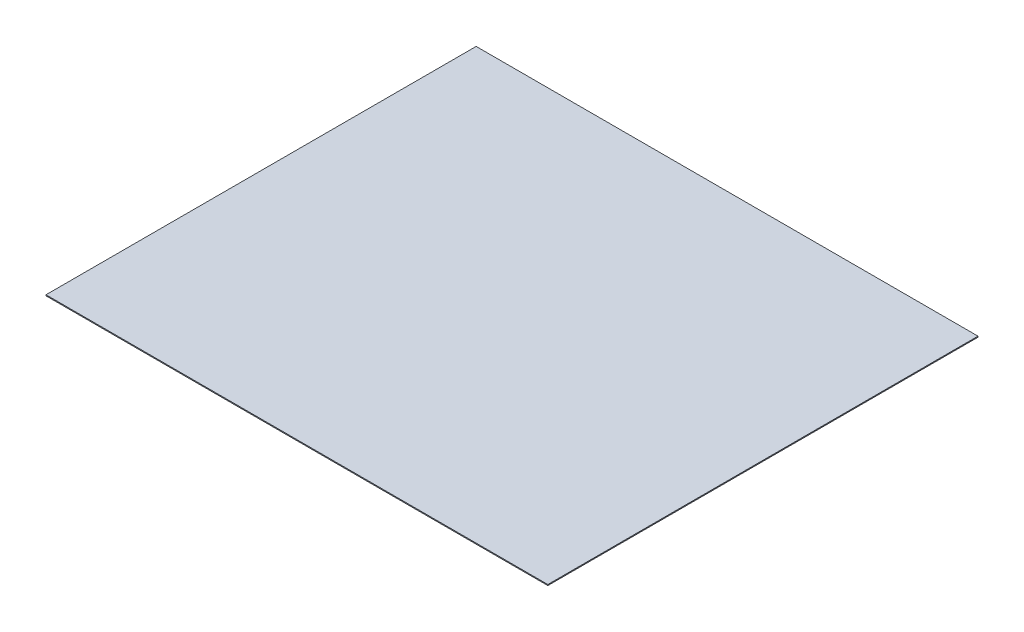
ISO-10303-21;
HEADER;
FILE_DESCRIPTION(('STEP AP214'),'2;1');
FILE_NAME('part.step','',(''),(''),'','','');
FILE_SCHEMA(('AUTOMOTIVE_DESIGN { 1 0 10303 214 1 1 1 1 }'));
ENDSEC;
DATA;
#1=APPLICATION_CONTEXT('core data for automotive mechanical design processes');
#2=APPLICATION_PROTOCOL_DEFINITION('international standard','automotive_design',2000,#1);
#3=PRODUCT_CONTEXT('',#1,'mechanical');
#4=PRODUCT('Part','Part','',(#3));
#5=PRODUCT_RELATED_PRODUCT_CATEGORY('part','',(#4));
#6=PRODUCT_DEFINITION_FORMATION('','',#4);
#7=PRODUCT_DEFINITION_CONTEXT('part definition',#1,'design');
#8=PRODUCT_DEFINITION('design','',#6,#7);
#9=PRODUCT_DEFINITION_SHAPE('','',#8);
#10=(LENGTH_UNIT() NAMED_UNIT(*) SI_UNIT(.MILLI.,.METRE.));
#11=(NAMED_UNIT(*) PLANE_ANGLE_UNIT() SI_UNIT($,.RADIAN.));
#12=(NAMED_UNIT(*) SI_UNIT($,.STERADIAN.) SOLID_ANGLE_UNIT());
#13=UNCERTAINTY_MEASURE_WITH_UNIT(LENGTH_MEASURE(1.E-05),#10,'distance_accuracy_value','');
#14=(GEOMETRIC_REPRESENTATION_CONTEXT(3) GLOBAL_UNCERTAINTY_ASSIGNED_CONTEXT((#13)) GLOBAL_UNIT_ASSIGNED_CONTEXT((#10,
#11,#12)) REPRESENTATION_CONTEXT('',''));
#15=CARTESIAN_POINT('',(0.,0.,0.));
#16=DIRECTION('',(0.,0.,1.));
#17=DIRECTION('',(1.,0.,0.));
#18=AXIS2_PLACEMENT_3D('',#15,#16,#17);
#19=CARTESIAN_POINT('',(133.35,0.508,-114.3));
#20=DIRECTION('',(-1.,0.,0.));
#21=DIRECTION('',(0.,0.,1.));
#22=AXIS2_PLACEMENT_3D('',#19,#20,#21);
#23=PLANE('',#22);
#24=DIRECTION('',(0.,0.,-1.));
#25=VECTOR('',#24,1.);
#26=CARTESIAN_POINT('',(133.35,0.,-114.3));
#27=LINE('',#26,#25);
#28=CARTESIAN_POINT('',(133.35,0.,114.3));
#29=VERTEX_POINT('',#28);
#30=CARTESIAN_POINT('',(133.35,0.,-114.3));
#31=VERTEX_POINT('',#30);
#32=EDGE_CURVE('E107',#29,#31,#27,.T.);
#33=ORIENTED_EDGE('',*,*,#32,.T.);
#34=DIRECTION('',(0.,-1.,0.));
#35=VECTOR('',#34,1.);
#36=CARTESIAN_POINT('',(133.35,0.508,-114.3));
#37=LINE('',#36,#35);
#38=CARTESIAN_POINT('',(133.35,0.508,-114.3));
#39=VERTEX_POINT('',#38);
#40=EDGE_CURVE('E11',#39,#31,#37,.T.);
#41=ORIENTED_EDGE('',*,*,#40,.F.);
#42=DIRECTION('',(0.,0.,-1.));
#43=VECTOR('',#42,1.);
#44=CARTESIAN_POINT('',(133.35,0.508,-114.3));
#45=LINE('',#44,#43);
#46=CARTESIAN_POINT('',(133.35,0.508,114.3));
#47=VERTEX_POINT('',#46);
#48=EDGE_CURVE('E91',#47,#39,#45,.T.);
#49=ORIENTED_EDGE('',*,*,#48,.F.);
#50=DIRECTION('',(0.,-1.,0.));
#51=VECTOR('',#50,1.);
#52=CARTESIAN_POINT('',(133.35,0.508,114.3));
#53=LINE('',#52,#51);
#54=EDGE_CURVE('E103',#47,#29,#53,.T.);
#55=ORIENTED_EDGE('',*,*,#54,.T.);
#56=EDGE_LOOP('',(#33,#41,#49,#55));
#57=FACE_BOUND('',#56,.T.);
#58=ADVANCED_FACE('F39',(#57),#23,.F.);
#59=CARTESIAN_POINT('',(-133.35,0.508,-114.3));
#60=DIRECTION('',(0.,0.,1.));
#61=DIRECTION('',(1.,0.,0.));
#62=AXIS2_PLACEMENT_3D('',#59,#60,#61);
#63=PLANE('',#62);
#64=DIRECTION('',(-1.,0.,0.));
#65=VECTOR('',#64,1.);
#66=CARTESIAN_POINT('',(-133.35,0.,-114.3));
#67=LINE('',#66,#65);
#68=CARTESIAN_POINT('',(-133.35,0.,-114.3));
#69=VERTEX_POINT('',#68);
#70=EDGE_CURVE('E96',#31,#69,#67,.T.);
#71=ORIENTED_EDGE('',*,*,#70,.T.);
#72=DIRECTION('',(0.,-1.,0.));
#73=VECTOR('',#72,1.);
#74=CARTESIAN_POINT('',(-133.35,0.508,-114.3));
#75=LINE('',#74,#73);
#76=CARTESIAN_POINT('',(-133.35,0.508,-114.3));
#77=VERTEX_POINT('',#76);
#78=EDGE_CURVE('E48',#77,#69,#75,.T.);
#79=ORIENTED_EDGE('',*,*,#78,.F.);
#80=DIRECTION('',(-1.,0.,0.));
#81=VECTOR('',#80,1.);
#82=CARTESIAN_POINT('',(-133.35,0.508,-114.3));
#83=LINE('',#82,#81);
#84=EDGE_CURVE('E86',#39,#77,#83,.T.);
#85=ORIENTED_EDGE('',*,*,#84,.F.);
#86=ORIENTED_EDGE('',*,*,#40,.T.);
#87=EDGE_LOOP('',(#71,#79,#85,#86));
#88=FACE_BOUND('',#87,.T.);
#89=ADVANCED_FACE('F95',(#88),#63,.F.);
#90=CARTESIAN_POINT('',(-133.35,0.508,-114.3));
#91=DIRECTION('',(1.,0.,0.));
#92=DIRECTION('',(0.,0.,-1.));
#93=AXIS2_PLACEMENT_3D('',#90,#91,#92);
#94=PLANE('',#93);
#95=DIRECTION('',(0.,0.,1.));
#96=VECTOR('',#95,1.);
#97=CARTESIAN_POINT('',(-133.35,0.,-114.3));
#98=LINE('',#97,#96);
#99=CARTESIAN_POINT('',(-133.35,0.,114.3));
#100=VERTEX_POINT('',#99);
#101=EDGE_CURVE('E73',#69,#100,#98,.T.);
#102=ORIENTED_EDGE('',*,*,#101,.T.);
#103=DIRECTION('',(0.,-1.,0.));
#104=VECTOR('',#103,1.);
#105=CARTESIAN_POINT('',(-133.35,0.508,114.3));
#106=LINE('',#105,#104);
#107=CARTESIAN_POINT('',(-133.35,0.508,114.3));
#108=VERTEX_POINT('',#107);
#109=EDGE_CURVE('E98',#108,#100,#106,.T.);
#110=ORIENTED_EDGE('',*,*,#109,.F.);
#111=DIRECTION('',(0.,0.,1.));
#112=VECTOR('',#111,1.);
#113=CARTESIAN_POINT('',(-133.35,0.508,-114.3));
#114=LINE('',#113,#112);
#115=EDGE_CURVE('E89',#77,#108,#114,.T.);
#116=ORIENTED_EDGE('',*,*,#115,.F.);
#117=ORIENTED_EDGE('',*,*,#78,.T.);
#118=EDGE_LOOP('',(#102,#110,#116,#117));
#119=FACE_BOUND('',#118,.T.);
#120=ADVANCED_FACE('F99',(#119),#94,.F.);
#121=CARTESIAN_POINT('',(-133.35,0.508,114.3));
#122=DIRECTION('',(0.,0.,-1.));
#123=DIRECTION('',(-1.,0.,0.));
#124=AXIS2_PLACEMENT_3D('',#121,#122,#123);
#125=PLANE('',#124);
#126=DIRECTION('',(1.,0.,0.));
#127=VECTOR('',#126,1.);
#128=CARTESIAN_POINT('',(-133.35,0.,114.3));
#129=LINE('',#128,#127);
#130=EDGE_CURVE('E79',#100,#29,#129,.T.);
#131=ORIENTED_EDGE('',*,*,#130,.T.);
#132=ORIENTED_EDGE('',*,*,#54,.F.);
#133=DIRECTION('',(1.,0.,0.));
#134=VECTOR('',#133,1.);
#135=CARTESIAN_POINT('',(-133.35,0.508,114.3));
#136=LINE('',#135,#134);
#137=EDGE_CURVE('E56',#108,#47,#136,.T.);
#138=ORIENTED_EDGE('',*,*,#137,.F.);
#139=ORIENTED_EDGE('',*,*,#109,.T.);
#140=EDGE_LOOP('',(#131,#132,#138,#139));
#141=FACE_BOUND('',#140,.T.);
#142=ADVANCED_FACE('F120',(#141),#125,.F.);
#143=CARTESIAN_POINT('',(0.,0.508,0.));
#144=DIRECTION('',(0.,1.,0.));
#145=DIRECTION('',(0.,0.,1.));
#146=AXIS2_PLACEMENT_3D('',#143,#144,#145);
#147=PLANE('',#146);
#148=ORIENTED_EDGE('',*,*,#48,.T.);
#149=ORIENTED_EDGE('',*,*,#84,.T.);
#150=ORIENTED_EDGE('',*,*,#115,.T.);
#151=ORIENTED_EDGE('',*,*,#137,.T.);
#152=EDGE_LOOP('',(#148,#149,#150,#151));
#153=FACE_BOUND('',#152,.T.);
#154=ADVANCED_FACE('F87',(#153),#147,.T.);
#155=CARTESIAN_POINT('',(0.,0.,0.));
#156=DIRECTION('',(0.,1.,0.));
#157=DIRECTION('',(0.,0.,1.));
#158=AXIS2_PLACEMENT_3D('',#155,#156,#157);
#159=PLANE('',#158);
#160=ORIENTED_EDGE('',*,*,#32,.F.);
#161=ORIENTED_EDGE('',*,*,#130,.F.);
#162=ORIENTED_EDGE('',*,*,#101,.F.);
#163=ORIENTED_EDGE('',*,*,#70,.F.);
#164=EDGE_LOOP('',(#160,#161,#162,#163));
#165=FACE_BOUND('',#164,.T.);
#166=ADVANCED_FACE('F123',(#165),#159,.F.);
#167=CLOSED_SHELL('',(#58,#89,#120,#142,#154,#166));
#168=MANIFOLD_SOLID_BREP('B2',#167);
#169=ADVANCED_BREP_SHAPE_REPRESENTATION('',(#18,#168),#14);
#170=SHAPE_DEFINITION_REPRESENTATION(#9,#169);
ENDSEC;
END-ISO-10303-21;
